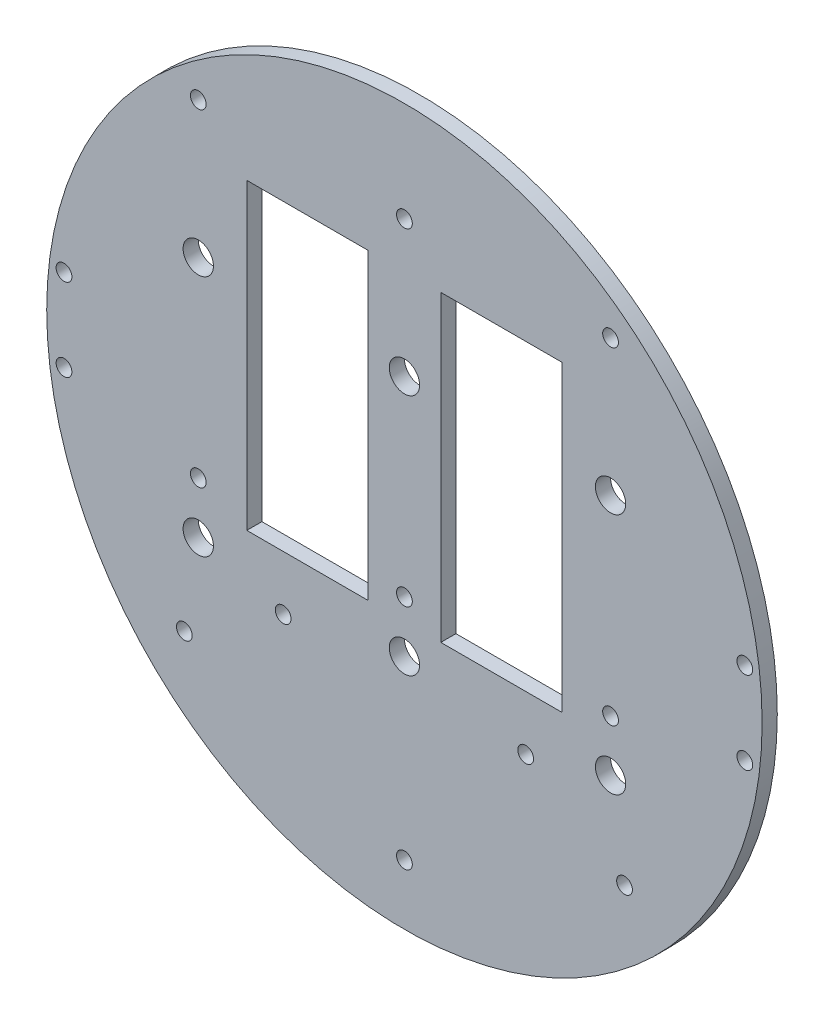
ISO-10303-21;
HEADER;
FILE_DESCRIPTION(('STEP AP214'),'2;1');
FILE_NAME('part.step','',(''),(''),'','','');
FILE_SCHEMA(('AUTOMOTIVE_DESIGN { 1 0 10303 214 1 1 1 1 }'));
ENDSEC;
DATA;
#1=APPLICATION_CONTEXT('core data for automotive mechanical design processes');
#2=APPLICATION_PROTOCOL_DEFINITION('international standard','automotive_design',2000,#1);
#3=PRODUCT_CONTEXT('',#1,'mechanical');
#4=PRODUCT('Part','Part','',(#3));
#5=PRODUCT_RELATED_PRODUCT_CATEGORY('part','',(#4));
#6=PRODUCT_DEFINITION_FORMATION('','',#4);
#7=PRODUCT_DEFINITION_CONTEXT('part definition',#1,'design');
#8=PRODUCT_DEFINITION('design','',#6,#7);
#9=PRODUCT_DEFINITION_SHAPE('','',#8);
#10=(LENGTH_UNIT() NAMED_UNIT(*) SI_UNIT(.MILLI.,.METRE.));
#11=(NAMED_UNIT(*) PLANE_ANGLE_UNIT() SI_UNIT($,.RADIAN.));
#12=(NAMED_UNIT(*) SI_UNIT($,.STERADIAN.) SOLID_ANGLE_UNIT());
#13=UNCERTAINTY_MEASURE_WITH_UNIT(LENGTH_MEASURE(1.E-05),#10,'distance_accuracy_value','');
#14=(GEOMETRIC_REPRESENTATION_CONTEXT(3) GLOBAL_UNCERTAINTY_ASSIGNED_CONTEXT((#13)) GLOBAL_UNIT_ASSIGNED_CONTEXT((#10,
#11,#12)) REPRESENTATION_CONTEXT('',''));
#15=CARTESIAN_POINT('',(0.,0.,0.));
#16=DIRECTION('',(0.,0.,1.));
#17=DIRECTION('',(1.,0.,0.));
#18=AXIS2_PLACEMENT_3D('',#15,#16,#17);
#19=CARTESIAN_POINT('',(0.,0.,3.175));
#20=DIRECTION('',(0.,0.,1.));
#21=DIRECTION('',(1.,0.,0.));
#22=AXIS2_PLACEMENT_3D('',#19,#20,#21);
#23=PLANE('',#22);
#24=CARTESIAN_POINT('',(71.3039757213085,8.63599999999998,3.175));
#25=DIRECTION('',(0.,0.,1.));
#26=DIRECTION('',(1.,0.,0.));
#27=AXIS2_PLACEMENT_3D('',#24,#25,#26);
#28=CIRCLE('',#27,1.65100000000001);
#29=CARTESIAN_POINT('',(72.9549757213085,8.63599999999998,3.175));
#30=VERTEX_POINT('',#29);
#31=EDGE_CURVE('E272',#30,#30,#28,.T.);
#32=ORIENTED_EDGE('',*,*,#31,.F.);
#33=EDGE_LOOP('',(#32));
#34=FACE_BOUND('',#33,.T.);
#35=CARTESIAN_POINT('',(-71.3039757213088,-8.63599999999998,3.175));
#36=DIRECTION('',(0.,0.,1.));
#37=DIRECTION('',(1.,0.,0.));
#38=AXIS2_PLACEMENT_3D('',#35,#36,#37);
#39=CIRCLE('',#38,1.65099999999999);
#40=CARTESIAN_POINT('',(-69.6529757213088,-8.63599999999998,3.175));
#41=VERTEX_POINT('',#40);
#42=EDGE_CURVE('E278',#41,#41,#39,.T.);
#43=ORIENTED_EDGE('',*,*,#42,.F.);
#44=EDGE_LOOP('',(#43));
#45=FACE_BOUND('',#44,.T.);
#46=CARTESIAN_POINT('',(-71.3039757213088,8.63600000000002,3.175));
#47=DIRECTION('',(0.,0.,1.));
#48=DIRECTION('',(1.,0.,0.));
#49=AXIS2_PLACEMENT_3D('',#46,#47,#48);
#50=CIRCLE('',#49,1.65099999999999);
#51=CARTESIAN_POINT('',(-69.6529757213088,8.63600000000002,3.175));
#52=VERTEX_POINT('',#51);
#53=EDGE_CURVE('E275',#52,#52,#50,.T.);
#54=ORIENTED_EDGE('',*,*,#53,.F.);
#55=EDGE_LOOP('',(#54));
#56=FACE_BOUND('',#55,.T.);
#57=CARTESIAN_POINT('',(71.3039757213085,-8.63600000000002,3.175));
#58=DIRECTION('',(0.,0.,1.));
#59=DIRECTION('',(1.,0.,0.));
#60=AXIS2_PLACEMENT_3D('',#57,#58,#59);
#61=CIRCLE('',#60,1.65100000000001);
#62=CARTESIAN_POINT('',(72.9549757213085,-8.63600000000002,3.175));
#63=VERTEX_POINT('',#62);
#64=EDGE_CURVE('E271',#63,#63,#61,.T.);
#65=ORIENTED_EDGE('',*,*,#64,.F.);
#66=EDGE_LOOP('',(#65));
#67=FACE_BOUND('',#66,.T.);
#68=DIRECTION('',(0.,-1.,0.));
#69=VECTOR('',#68,1.);
#70=CARTESIAN_POINT('',(-33.02,0.,3.175));
#71=LINE('',#70,#69);
#72=CARTESIAN_POINT('',(-33.02,44.45,3.175));
#73=VERTEX_POINT('',#72);
#74=CARTESIAN_POINT('',(-33.02,-19.05,3.175));
#75=VERTEX_POINT('',#74);
#76=EDGE_CURVE('E133',#73,#75,#71,.T.);
#77=ORIENTED_EDGE('',*,*,#76,.F.);
#78=DIRECTION('',(-1.,0.,0.));
#79=VECTOR('',#78,1.);
#80=CARTESIAN_POINT('',(0.,44.45,3.175));
#81=LINE('',#80,#79);
#82=CARTESIAN_POINT('',(-7.62000000000001,44.45,3.175));
#83=VERTEX_POINT('',#82);
#84=EDGE_CURVE('E126',#83,#73,#81,.T.);
#85=ORIENTED_EDGE('',*,*,#84,.F.);
#86=DIRECTION('',(0.,1.,0.));
#87=VECTOR('',#86,1.);
#88=CARTESIAN_POINT('',(-7.62,0.,3.175));
#89=LINE('',#88,#87);
#90=CARTESIAN_POINT('',(-7.62,-19.05,3.175));
#91=VERTEX_POINT('',#90);
#92=EDGE_CURVE('E106',#91,#83,#89,.T.);
#93=ORIENTED_EDGE('',*,*,#92,.F.);
#94=DIRECTION('',(1.,0.,0.));
#95=VECTOR('',#94,1.);
#96=CARTESIAN_POINT('',(0.,-19.05,3.175));
#97=LINE('',#96,#95);
#98=EDGE_CURVE('E131',#75,#91,#97,.T.);
#99=ORIENTED_EDGE('',*,*,#98,.F.);
#100=EDGE_LOOP('',(#77,#85,#93,#99));
#101=FACE_BOUND('',#100,.T.);
#102=DIRECTION('',(0.,1.,0.));
#103=VECTOR('',#102,1.);
#104=CARTESIAN_POINT('',(33.02,0.,3.175));
#105=LINE('',#104,#103);
#106=CARTESIAN_POINT('',(33.02,-19.05,3.175));
#107=VERTEX_POINT('',#106);
#108=CARTESIAN_POINT('',(33.02,44.45,3.175));
#109=VERTEX_POINT('',#108);
#110=EDGE_CURVE('E162',#107,#109,#105,.T.);
#111=ORIENTED_EDGE('',*,*,#110,.F.);
#112=DIRECTION('',(1.,0.,0.));
#113=VECTOR('',#112,1.);
#114=CARTESIAN_POINT('',(0.,-19.05,3.175));
#115=LINE('',#114,#113);
#116=CARTESIAN_POINT('',(7.62,-19.05,3.175));
#117=VERTEX_POINT('',#116);
#118=EDGE_CURVE('E149',#117,#107,#115,.T.);
#119=ORIENTED_EDGE('',*,*,#118,.F.);
#120=DIRECTION('',(0.,-1.,0.));
#121=VECTOR('',#120,1.);
#122=CARTESIAN_POINT('',(7.62,0.,3.175));
#123=LINE('',#122,#121);
#124=CARTESIAN_POINT('',(7.62000000000001,44.45,3.175));
#125=VERTEX_POINT('',#124);
#126=EDGE_CURVE('E157',#125,#117,#123,.T.);
#127=ORIENTED_EDGE('',*,*,#126,.F.);
#128=DIRECTION('',(-1.,0.,0.));
#129=VECTOR('',#128,1.);
#130=CARTESIAN_POINT('',(0.,44.45,3.175));
#131=LINE('',#130,#129);
#132=EDGE_CURVE('E160',#109,#125,#131,.T.);
#133=ORIENTED_EDGE('',*,*,#132,.F.);
#134=EDGE_LOOP('',(#111,#119,#127,#133));
#135=FACE_BOUND('',#134,.T.);
#136=CARTESIAN_POINT('',(-43.18,25.4,3.175));
#137=DIRECTION('',(0.,0.,1.));
#138=DIRECTION('',(1.,0.,0.));
#139=AXIS2_PLACEMENT_3D('',#136,#137,#138);
#140=CIRCLE('',#139,3.175);
#141=CARTESIAN_POINT('',(-40.005,25.4,3.175));
#142=VERTEX_POINT('',#141);
#143=EDGE_CURVE('E191',#142,#142,#140,.T.);
#144=ORIENTED_EDGE('',*,*,#143,.F.);
#145=EDGE_LOOP('',(#144));
#146=FACE_BOUND('',#145,.T.);
#147=CARTESIAN_POINT('',(43.18,25.4,3.175));
#148=DIRECTION('',(0.,0.,1.));
#149=DIRECTION('',(1.,0.,0.));
#150=AXIS2_PLACEMENT_3D('',#147,#148,#149);
#151=CIRCLE('',#150,3.175);
#152=CARTESIAN_POINT('',(46.355,25.4,3.175));
#153=VERTEX_POINT('',#152);
#154=EDGE_CURVE('E188',#153,#153,#151,.T.);
#155=ORIENTED_EDGE('',*,*,#154,.F.);
#156=EDGE_LOOP('',(#155));
#157=FACE_BOUND('',#156,.T.);
#158=CARTESIAN_POINT('',(43.18,-25.4,3.175));
#159=DIRECTION('',(0.,0.,1.));
#160=DIRECTION('',(1.,0.,0.));
#161=AXIS2_PLACEMENT_3D('',#158,#159,#160);
#162=CIRCLE('',#161,3.175);
#163=CARTESIAN_POINT('',(46.355,-25.4,3.175));
#164=VERTEX_POINT('',#163);
#165=EDGE_CURVE('E185',#164,#164,#162,.T.);
#166=ORIENTED_EDGE('',*,*,#165,.F.);
#167=EDGE_LOOP('',(#166));
#168=FACE_BOUND('',#167,.T.);
#169=CARTESIAN_POINT('',(0.,-25.4,3.175));
#170=DIRECTION('',(0.,0.,1.));
#171=DIRECTION('',(1.,0.,0.));
#172=AXIS2_PLACEMENT_3D('',#169,#170,#171);
#173=CIRCLE('',#172,3.175);
#174=CARTESIAN_POINT('',(3.175,-25.4,3.175));
#175=VERTEX_POINT('',#174);
#176=EDGE_CURVE('E182',#175,#175,#173,.T.);
#177=ORIENTED_EDGE('',*,*,#176,.F.);
#178=EDGE_LOOP('',(#177));
#179=FACE_BOUND('',#178,.T.);
#180=CARTESIAN_POINT('',(-43.18,-25.4,3.175));
#181=DIRECTION('',(0.,0.,1.));
#182=DIRECTION('',(1.,0.,0.));
#183=AXIS2_PLACEMENT_3D('',#180,#181,#182);
#184=CIRCLE('',#183,3.175);
#185=CARTESIAN_POINT('',(-40.005,-25.4,3.175));
#186=VERTEX_POINT('',#185);
#187=EDGE_CURVE('E168',#186,#186,#184,.T.);
#188=ORIENTED_EDGE('',*,*,#187,.F.);
#189=EDGE_LOOP('',(#188));
#190=FACE_BOUND('',#189,.T.);
#191=CARTESIAN_POINT('',(0.,25.4,3.175));
#192=DIRECTION('',(0.,0.,1.));
#193=DIRECTION('',(1.,0.,0.));
#194=AXIS2_PLACEMENT_3D('',#191,#192,#193);
#195=CIRCLE('',#194,3.175);
#196=CARTESIAN_POINT('',(3.175,25.4,3.175));
#197=VERTEX_POINT('',#196);
#198=EDGE_CURVE('E197',#197,#197,#195,.T.);
#199=ORIENTED_EDGE('',*,*,#198,.F.);
#200=EDGE_LOOP('',(#199));
#201=FACE_BOUND('',#200,.T.);
#202=CARTESIAN_POINT('',(0.,0.,3.175));
#203=DIRECTION('',(0.,0.,1.));
#204=DIRECTION('',(1.,0.,0.));
#205=AXIS2_PLACEMENT_3D('',#202,#203,#204);
#206=CIRCLE('',#205,74.93);
#207=CARTESIAN_POINT('',(74.93,0.,3.175));
#208=VERTEX_POINT('',#207);
#209=EDGE_CURVE('E11',#208,#208,#206,.T.);
#210=ORIENTED_EDGE('',*,*,#209,.T.);
#211=EDGE_LOOP('',(#210));
#212=FACE_BOUND('',#211,.T.);
#213=CARTESIAN_POINT('',(25.4,-30.48,3.175));
#214=DIRECTION('',(0.,0.,-1.));
#215=DIRECTION('',(-1.,0.,0.));
#216=AXIS2_PLACEMENT_3D('',#213,#214,#215);
#217=CIRCLE('',#216,1.651);
#218=CARTESIAN_POINT('',(23.749,-30.48,3.175));
#219=VERTEX_POINT('',#218);
#220=EDGE_CURVE('E226',#219,#219,#217,.T.);
#221=ORIENTED_EDGE('',*,*,#220,.T.);
#222=EDGE_LOOP('',(#221));
#223=FACE_BOUND('',#222,.T.);
#224=CARTESIAN_POINT('',(-25.4,-30.48,3.175));
#225=DIRECTION('',(0.,0.,-1.));
#226=DIRECTION('',(1.,0.,0.));
#227=AXIS2_PLACEMENT_3D('',#224,#225,#226);
#228=CIRCLE('',#227,1.651);
#229=CARTESIAN_POINT('',(-23.749,-30.48,3.175));
#230=VERTEX_POINT('',#229);
#231=EDGE_CURVE('E220',#230,#230,#228,.T.);
#232=ORIENTED_EDGE('',*,*,#231,.T.);
#233=EDGE_LOOP('',(#232));
#234=FACE_BOUND('',#233,.T.);
#235=CARTESIAN_POINT('',(0.,-62.3219988,3.175));
#236=DIRECTION('',(0.,0.,-1.));
#237=DIRECTION('',(-1.,0.,0.));
#238=AXIS2_PLACEMENT_3D('',#235,#236,#237);
#239=CIRCLE('',#238,1.651);
#240=CARTESIAN_POINT('',(-1.65100000000002,-62.3219988,3.175));
#241=VERTEX_POINT('',#240);
#242=EDGE_CURVE('E214',#241,#241,#239,.T.);
#243=ORIENTED_EDGE('',*,*,#242,.T.);
#244=EDGE_LOOP('',(#243));
#245=FACE_BOUND('',#244,.T.);
#246=CARTESIAN_POINT('',(43.18,53.975,3.175));
#247=DIRECTION('',(0.,0.,-1.));
#248=DIRECTION('',(-1.,0.,0.));
#249=AXIS2_PLACEMENT_3D('',#246,#247,#248);
#250=CIRCLE('',#249,1.651);
#251=CARTESIAN_POINT('',(41.529,53.975,3.175));
#252=VERTEX_POINT('',#251);
#253=EDGE_CURVE('E208',#252,#252,#250,.T.);
#254=ORIENTED_EDGE('',*,*,#253,.T.);
#255=EDGE_LOOP('',(#254));
#256=FACE_BOUND('',#255,.T.);
#257=CARTESIAN_POINT('',(46.101,-43.8609994,3.175));
#258=DIRECTION('',(0.,0.,-1.));
#259=DIRECTION('',(-1.,0.,0.));
#260=AXIS2_PLACEMENT_3D('',#257,#258,#259);
#261=CIRCLE('',#260,1.651);
#262=CARTESIAN_POINT('',(44.45,-43.8609994,3.175));
#263=VERTEX_POINT('',#262);
#264=EDGE_CURVE('E201',#263,#263,#261,.T.);
#265=ORIENTED_EDGE('',*,*,#264,.T.);
#266=EDGE_LOOP('',(#265));
#267=FACE_BOUND('',#266,.T.);
#268=CARTESIAN_POINT('',(-43.18,53.975,3.175));
#269=DIRECTION('',(0.,0.,-1.));
#270=DIRECTION('',(-1.,0.,0.));
#271=AXIS2_PLACEMENT_3D('',#268,#269,#270);
#272=CIRCLE('',#271,1.651);
#273=CARTESIAN_POINT('',(-44.831,53.975,3.175));
#274=VERTEX_POINT('',#273);
#275=EDGE_CURVE('E249',#274,#274,#272,.T.);
#276=ORIENTED_EDGE('',*,*,#275,.T.);
#277=EDGE_LOOP('',(#276));
#278=FACE_BOUND('',#277,.T.);
#279=CARTESIAN_POINT('',(0.,-14.605,3.175));
#280=DIRECTION('',(0.,0.,-1.));
#281=DIRECTION('',(-1.,0.,0.));
#282=AXIS2_PLACEMENT_3D('',#279,#280,#281);
#283=CIRCLE('',#282,1.651);
#284=CARTESIAN_POINT('',(-1.65100000000001,-14.605,3.175));
#285=VERTEX_POINT('',#284);
#286=EDGE_CURVE('E256',#285,#285,#283,.T.);
#287=ORIENTED_EDGE('',*,*,#286,.T.);
#288=EDGE_LOOP('',(#287));
#289=FACE_BOUND('',#288,.T.);
#290=CARTESIAN_POINT('',(-46.101,-43.8609994,3.175));
#291=DIRECTION('',(0.,0.,-1.));
#292=DIRECTION('',(-1.,0.,0.));
#293=AXIS2_PLACEMENT_3D('',#290,#291,#292);
#294=CIRCLE('',#293,1.65100000000001);
#295=CARTESIAN_POINT('',(-47.752,-43.8609994,3.175));
#296=VERTEX_POINT('',#295);
#297=EDGE_CURVE('E238',#296,#296,#294,.T.);
#298=ORIENTED_EDGE('',*,*,#297,.T.);
#299=EDGE_LOOP('',(#298));
#300=FACE_BOUND('',#299,.T.);
#301=CARTESIAN_POINT('',(43.18,-14.605,3.175));
#302=DIRECTION('',(0.,0.,-1.));
#303=DIRECTION('',(-1.,0.,0.));
#304=AXIS2_PLACEMENT_3D('',#301,#302,#303);
#305=CIRCLE('',#304,1.651);
#306=CARTESIAN_POINT('',(41.529,-14.605,3.175));
#307=VERTEX_POINT('',#306);
#308=EDGE_CURVE('E231',#307,#307,#305,.T.);
#309=ORIENTED_EDGE('',*,*,#308,.T.);
#310=EDGE_LOOP('',(#309));
#311=FACE_BOUND('',#310,.T.);
#312=CARTESIAN_POINT('',(-43.18,-14.605,3.175));
#313=DIRECTION('',(0.,0.,-1.));
#314=DIRECTION('',(-1.,0.,0.));
#315=AXIS2_PLACEMENT_3D('',#312,#313,#314);
#316=CIRCLE('',#315,1.651);
#317=CARTESIAN_POINT('',(-44.831,-14.605,3.175));
#318=VERTEX_POINT('',#317);
#319=EDGE_CURVE('E243',#318,#318,#316,.T.);
#320=ORIENTED_EDGE('',*,*,#319,.T.);
#321=EDGE_LOOP('',(#320));
#322=FACE_BOUND('',#321,.T.);
#323=CARTESIAN_POINT('',(0.,53.975,3.175));
#324=DIRECTION('',(0.,0.,-1.));
#325=DIRECTION('',(-1.,0.,0.));
#326=AXIS2_PLACEMENT_3D('',#323,#324,#325);
#327=CIRCLE('',#326,1.65099999999999);
#328=CARTESIAN_POINT('',(-1.651,53.975,3.175));
#329=VERTEX_POINT('',#328);
#330=EDGE_CURVE('E261',#329,#329,#327,.T.);
#331=ORIENTED_EDGE('',*,*,#330,.T.);
#332=EDGE_LOOP('',(#331));
#333=FACE_BOUND('',#332,.T.);
#334=ADVANCED_FACE('F33',(#34,#45,#56,#67,#101,#135,#146,#157,#168,#179,#190,#201,#212,#223,
#234,#245,#256,#267,#278,#289,#300,#311,#322,#333),#23,.T.);
#335=CARTESIAN_POINT('',(0.,0.,0.));
#336=DIRECTION('',(0.,0.,1.));
#337=DIRECTION('',(1.,0.,0.));
#338=AXIS2_PLACEMENT_3D('',#335,#336,#337);
#339=PLANE('',#338);
#340=CARTESIAN_POINT('',(71.3039757213085,8.63599999999998,0.));
#341=DIRECTION('',(0.,0.,1.));
#342=DIRECTION('',(1.,0.,0.));
#343=AXIS2_PLACEMENT_3D('',#340,#341,#342);
#344=CIRCLE('',#343,1.65100000000001);
#345=CARTESIAN_POINT('',(72.9549757213085,8.63599999999998,0.));
#346=VERTEX_POINT('',#345);
#347=EDGE_CURVE('E37',#346,#346,#344,.T.);
#348=ORIENTED_EDGE('',*,*,#347,.T.);
#349=EDGE_LOOP('',(#348));
#350=FACE_BOUND('',#349,.T.);
#351=CARTESIAN_POINT('',(-71.3039757213088,-8.63599999999998,0.));
#352=DIRECTION('',(0.,0.,1.));
#353=DIRECTION('',(1.,0.,0.));
#354=AXIS2_PLACEMENT_3D('',#351,#352,#353);
#355=CIRCLE('',#354,1.65099999999999);
#356=CARTESIAN_POINT('',(-69.6529757213088,-8.63599999999998,0.));
#357=VERTEX_POINT('',#356);
#358=EDGE_CURVE('E276',#357,#357,#355,.T.);
#359=ORIENTED_EDGE('',*,*,#358,.T.);
#360=EDGE_LOOP('',(#359));
#361=FACE_BOUND('',#360,.T.);
#362=CARTESIAN_POINT('',(-71.3039757213088,8.63600000000002,0.));
#363=DIRECTION('',(0.,0.,1.));
#364=DIRECTION('',(1.,0.,0.));
#365=AXIS2_PLACEMENT_3D('',#362,#363,#364);
#366=CIRCLE('',#365,1.65099999999999);
#367=CARTESIAN_POINT('',(-69.6529757213088,8.63600000000002,0.));
#368=VERTEX_POINT('',#367);
#369=EDGE_CURVE('E273',#368,#368,#366,.T.);
#370=ORIENTED_EDGE('',*,*,#369,.T.);
#371=EDGE_LOOP('',(#370));
#372=FACE_BOUND('',#371,.T.);
#373=CARTESIAN_POINT('',(71.3039757213085,-8.63600000000002,0.));
#374=DIRECTION('',(0.,0.,1.));
#375=DIRECTION('',(1.,0.,0.));
#376=AXIS2_PLACEMENT_3D('',#373,#374,#375);
#377=CIRCLE('',#376,1.65100000000001);
#378=CARTESIAN_POINT('',(72.9549757213085,-8.63600000000002,0.));
#379=VERTEX_POINT('',#378);
#380=EDGE_CURVE('E268',#379,#379,#377,.T.);
#381=ORIENTED_EDGE('',*,*,#380,.T.);
#382=EDGE_LOOP('',(#381));
#383=FACE_BOUND('',#382,.T.);
#384=DIRECTION('',(1.,0.,0.));
#385=VECTOR('',#384,1.);
#386=CARTESIAN_POINT('',(-33.02,44.45,0.));
#387=LINE('',#386,#385);
#388=CARTESIAN_POINT('',(-33.02,44.45,0.));
#389=VERTEX_POINT('',#388);
#390=CARTESIAN_POINT('',(-7.62000000000001,44.45,0.));
#391=VERTEX_POINT('',#390);
#392=EDGE_CURVE('E112',#389,#391,#387,.T.);
#393=ORIENTED_EDGE('',*,*,#392,.F.);
#394=DIRECTION('',(0.,1.,0.));
#395=VECTOR('',#394,1.);
#396=CARTESIAN_POINT('',(-33.02,44.45,0.));
#397=LINE('',#396,#395);
#398=CARTESIAN_POINT('',(-33.02,-19.05,0.));
#399=VERTEX_POINT('',#398);
#400=EDGE_CURVE('E58',#399,#389,#397,.T.);
#401=ORIENTED_EDGE('',*,*,#400,.F.);
#402=DIRECTION('',(-1.,0.,0.));
#403=VECTOR('',#402,1.);
#404=CARTESIAN_POINT('',(-33.02,-19.05,0.));
#405=LINE('',#404,#403);
#406=CARTESIAN_POINT('',(-7.62,-19.05,0.));
#407=VERTEX_POINT('',#406);
#408=EDGE_CURVE('E119',#407,#399,#405,.T.);
#409=ORIENTED_EDGE('',*,*,#408,.F.);
#410=DIRECTION('',(0.,-1.,0.));
#411=VECTOR('',#410,1.);
#412=CARTESIAN_POINT('',(-7.62000000000001,44.45,0.));
#413=LINE('',#412,#411);
#414=EDGE_CURVE('E103',#391,#407,#413,.T.);
#415=ORIENTED_EDGE('',*,*,#414,.F.);
#416=EDGE_LOOP('',(#393,#401,#409,#415));
#417=FACE_BOUND('',#416,.T.);
#418=DIRECTION('',(-1.,0.,0.));
#419=VECTOR('',#418,1.);
#420=CARTESIAN_POINT('',(33.02,-19.05,0.));
#421=LINE('',#420,#419);
#422=CARTESIAN_POINT('',(33.02,-19.05,0.));
#423=VERTEX_POINT('',#422);
#424=CARTESIAN_POINT('',(7.62,-19.05,0.));
#425=VERTEX_POINT('',#424);
#426=EDGE_CURVE('E137',#423,#425,#421,.T.);
#427=ORIENTED_EDGE('',*,*,#426,.F.);
#428=DIRECTION('',(0.,-1.,0.));
#429=VECTOR('',#428,1.);
#430=CARTESIAN_POINT('',(33.02,44.45,0.));
#431=LINE('',#430,#429);
#432=CARTESIAN_POINT('',(33.02,44.45,0.));
#433=VERTEX_POINT('',#432);
#434=EDGE_CURVE('E135',#433,#423,#431,.T.);
#435=ORIENTED_EDGE('',*,*,#434,.F.);
#436=DIRECTION('',(1.,0.,0.));
#437=VECTOR('',#436,1.);
#438=CARTESIAN_POINT('',(33.02,44.45,0.));
#439=LINE('',#438,#437);
#440=CARTESIAN_POINT('',(7.62000000000001,44.45,0.));
#441=VERTEX_POINT('',#440);
#442=EDGE_CURVE('E143',#441,#433,#439,.T.);
#443=ORIENTED_EDGE('',*,*,#442,.F.);
#444=DIRECTION('',(0.,1.,0.));
#445=VECTOR('',#444,1.);
#446=CARTESIAN_POINT('',(7.62000000000001,44.45,0.));
#447=LINE('',#446,#445);
#448=EDGE_CURVE('E140',#425,#441,#447,.T.);
#449=ORIENTED_EDGE('',*,*,#448,.F.);
#450=EDGE_LOOP('',(#427,#435,#443,#449));
#451=FACE_BOUND('',#450,.T.);
#452=CARTESIAN_POINT('',(-43.18,25.4,0.));
#453=DIRECTION('',(0.,0.,-1.));
#454=DIRECTION('',(-1.,0.,0.));
#455=AXIS2_PLACEMENT_3D('',#452,#453,#454);
#456=CIRCLE('',#455,3.175);
#457=CARTESIAN_POINT('',(-46.355,25.4,0.));
#458=VERTEX_POINT('',#457);
#459=EDGE_CURVE('E165',#458,#458,#456,.T.);
#460=ORIENTED_EDGE('',*,*,#459,.F.);
#461=EDGE_LOOP('',(#460));
#462=FACE_BOUND('',#461,.T.);
#463=CARTESIAN_POINT('',(43.18,25.4,0.));
#464=DIRECTION('',(0.,0.,-1.));
#465=DIRECTION('',(1.,0.,0.));
#466=AXIS2_PLACEMENT_3D('',#463,#464,#465);
#467=CIRCLE('',#466,3.175);
#468=CARTESIAN_POINT('',(46.355,25.4,0.));
#469=VERTEX_POINT('',#468);
#470=EDGE_CURVE('E169',#469,#469,#467,.T.);
#471=ORIENTED_EDGE('',*,*,#470,.F.);
#472=EDGE_LOOP('',(#471));
#473=FACE_BOUND('',#472,.T.);
#474=CARTESIAN_POINT('',(43.18,-25.4,0.));
#475=DIRECTION('',(0.,0.,-1.));
#476=DIRECTION('',(-1.,0.,0.));
#477=AXIS2_PLACEMENT_3D('',#474,#475,#476);
#478=CIRCLE('',#477,3.175);
#479=CARTESIAN_POINT('',(40.005,-25.4,0.));
#480=VERTEX_POINT('',#479);
#481=EDGE_CURVE('E172',#480,#480,#478,.T.);
#482=ORIENTED_EDGE('',*,*,#481,.F.);
#483=EDGE_LOOP('',(#482));
#484=FACE_BOUND('',#483,.T.);
#485=CARTESIAN_POINT('',(0.,-25.4,0.));
#486=DIRECTION('',(0.,0.,-1.));
#487=DIRECTION('',(1.,0.,0.));
#488=AXIS2_PLACEMENT_3D('',#485,#486,#487);
#489=CIRCLE('',#488,3.175);
#490=CARTESIAN_POINT('',(3.175,-25.4,0.));
#491=VERTEX_POINT('',#490);
#492=EDGE_CURVE('E175',#491,#491,#489,.T.);
#493=ORIENTED_EDGE('',*,*,#492,.F.);
#494=EDGE_LOOP('',(#493));
#495=FACE_BOUND('',#494,.T.);
#496=CARTESIAN_POINT('',(-43.18,-25.4,0.));
#497=DIRECTION('',(0.,0.,-1.));
#498=DIRECTION('',(1.,0.,0.));
#499=AXIS2_PLACEMENT_3D('',#496,#497,#498);
#500=CIRCLE('',#499,3.175);
#501=CARTESIAN_POINT('',(-40.005,-25.4,0.));
#502=VERTEX_POINT('',#501);
#503=EDGE_CURVE('E164',#502,#502,#500,.T.);
#504=ORIENTED_EDGE('',*,*,#503,.F.);
#505=EDGE_LOOP('',(#504));
#506=FACE_BOUND('',#505,.T.);
#507=CARTESIAN_POINT('',(0.,25.4,0.));
#508=DIRECTION('',(0.,0.,-1.));
#509=DIRECTION('',(-1.,0.,0.));
#510=AXIS2_PLACEMENT_3D('',#507,#508,#509);
#511=CIRCLE('',#510,3.175);
#512=CARTESIAN_POINT('',(-3.175,25.4,0.));
#513=VERTEX_POINT('',#512);
#514=EDGE_CURVE('E194',#513,#513,#511,.T.);
#515=ORIENTED_EDGE('',*,*,#514,.F.);
#516=EDGE_LOOP('',(#515));
#517=FACE_BOUND('',#516,.T.);
#518=CARTESIAN_POINT('',(25.4,-30.48,0.));
#519=DIRECTION('',(0.,0.,-1.));
#520=DIRECTION('',(-1.,0.,0.));
#521=AXIS2_PLACEMENT_3D('',#518,#519,#520);
#522=CIRCLE('',#521,1.651);
#523=CARTESIAN_POINT('',(23.749,-30.48,0.));
#524=VERTEX_POINT('',#523);
#525=EDGE_CURVE('E200',#524,#524,#522,.T.);
#526=ORIENTED_EDGE('',*,*,#525,.F.);
#527=EDGE_LOOP('',(#526));
#528=FACE_BOUND('',#527,.T.);
#529=CARTESIAN_POINT('',(-25.4,-30.48,0.));
#530=DIRECTION('',(0.,0.,-1.));
#531=DIRECTION('',(1.,0.,0.));
#532=AXIS2_PLACEMENT_3D('',#529,#530,#531);
#533=CIRCLE('',#532,1.651);
#534=CARTESIAN_POINT('',(-23.749,-30.48,0.));
#535=VERTEX_POINT('',#534);
#536=EDGE_CURVE('E223',#535,#535,#533,.T.);
#537=ORIENTED_EDGE('',*,*,#536,.F.);
#538=EDGE_LOOP('',(#537));
#539=FACE_BOUND('',#538,.T.);
#540=CARTESIAN_POINT('',(0.,-62.3219988,0.));
#541=DIRECTION('',(0.,0.,-1.));
#542=DIRECTION('',(-1.,0.,0.));
#543=AXIS2_PLACEMENT_3D('',#540,#541,#542);
#544=CIRCLE('',#543,1.651);
#545=CARTESIAN_POINT('',(-1.65100000000002,-62.3219988,0.));
#546=VERTEX_POINT('',#545);
#547=EDGE_CURVE('E217',#546,#546,#544,.T.);
#548=ORIENTED_EDGE('',*,*,#547,.F.);
#549=EDGE_LOOP('',(#548));
#550=FACE_BOUND('',#549,.T.);
#551=CARTESIAN_POINT('',(43.18,53.975,0.));
#552=DIRECTION('',(0.,0.,-1.));
#553=DIRECTION('',(-1.,0.,0.));
#554=AXIS2_PLACEMENT_3D('',#551,#552,#553);
#555=CIRCLE('',#554,1.651);
#556=CARTESIAN_POINT('',(41.529,53.975,0.));
#557=VERTEX_POINT('',#556);
#558=EDGE_CURVE('E211',#557,#557,#555,.T.);
#559=ORIENTED_EDGE('',*,*,#558,.F.);
#560=EDGE_LOOP('',(#559));
#561=FACE_BOUND('',#560,.T.);
#562=CARTESIAN_POINT('',(46.101,-43.8609994,0.));
#563=DIRECTION('',(0.,0.,-1.));
#564=DIRECTION('',(-1.,0.,0.));
#565=AXIS2_PLACEMENT_3D('',#562,#563,#564);
#566=CIRCLE('',#565,1.651);
#567=CARTESIAN_POINT('',(44.45,-43.8609994,0.));
#568=VERTEX_POINT('',#567);
#569=EDGE_CURVE('E205',#568,#568,#566,.T.);
#570=ORIENTED_EDGE('',*,*,#569,.F.);
#571=EDGE_LOOP('',(#570));
#572=FACE_BOUND('',#571,.T.);
#573=CARTESIAN_POINT('',(-43.18,53.975,0.));
#574=DIRECTION('',(0.,0.,-1.));
#575=DIRECTION('',(-1.,0.,0.));
#576=AXIS2_PLACEMENT_3D('',#573,#574,#575);
#577=CIRCLE('',#576,1.651);
#578=CARTESIAN_POINT('',(-44.831,53.975,0.));
#579=VERTEX_POINT('',#578);
#580=EDGE_CURVE('E253',#579,#579,#577,.T.);
#581=ORIENTED_EDGE('',*,*,#580,.F.);
#582=EDGE_LOOP('',(#581));
#583=FACE_BOUND('',#582,.T.);
#584=CARTESIAN_POINT('',(0.,-14.605,0.));
#585=DIRECTION('',(0.,0.,-1.));
#586=DIRECTION('',(-1.,0.,0.));
#587=AXIS2_PLACEMENT_3D('',#584,#585,#586);
#588=CIRCLE('',#587,1.651);
#589=CARTESIAN_POINT('',(-1.65100000000001,-14.605,0.));
#590=VERTEX_POINT('',#589);
#591=EDGE_CURVE('E246',#590,#590,#588,.T.);
#592=ORIENTED_EDGE('',*,*,#591,.F.);
#593=EDGE_LOOP('',(#592));
#594=FACE_BOUND('',#593,.T.);
#595=CARTESIAN_POINT('',(-46.101,-43.8609994,0.));
#596=DIRECTION('',(0.,0.,-1.));
#597=DIRECTION('',(-1.,0.,0.));
#598=AXIS2_PLACEMENT_3D('',#595,#596,#597);
#599=CIRCLE('',#598,1.65100000000001);
#600=CARTESIAN_POINT('',(-47.752,-43.8609994,0.));
#601=VERTEX_POINT('',#600);
#602=EDGE_CURVE('E204',#601,#601,#599,.T.);
#603=ORIENTED_EDGE('',*,*,#602,.F.);
#604=EDGE_LOOP('',(#603));
#605=FACE_BOUND('',#604,.T.);
#606=CARTESIAN_POINT('',(43.18,-14.605,0.));
#607=DIRECTION('',(0.,0.,-1.));
#608=DIRECTION('',(-1.,0.,0.));
#609=AXIS2_PLACEMENT_3D('',#606,#607,#608);
#610=CIRCLE('',#609,1.651);
#611=CARTESIAN_POINT('',(41.529,-14.605,0.));
#612=VERTEX_POINT('',#611);
#613=EDGE_CURVE('E235',#612,#612,#610,.T.);
#614=ORIENTED_EDGE('',*,*,#613,.F.);
#615=EDGE_LOOP('',(#614));
#616=FACE_BOUND('',#615,.T.);
#617=CARTESIAN_POINT('',(-43.18,-14.605,0.));
#618=DIRECTION('',(0.,0.,-1.));
#619=DIRECTION('',(-1.,0.,0.));
#620=AXIS2_PLACEMENT_3D('',#617,#618,#619);
#621=CIRCLE('',#620,1.651);
#622=CARTESIAN_POINT('',(-44.831,-14.605,0.));
#623=VERTEX_POINT('',#622);
#624=EDGE_CURVE('E234',#623,#623,#621,.T.);
#625=ORIENTED_EDGE('',*,*,#624,.F.);
#626=EDGE_LOOP('',(#625));
#627=FACE_BOUND('',#626,.T.);
#628=CARTESIAN_POINT('',(0.,53.975,0.));
#629=DIRECTION('',(0.,0.,-1.));
#630=DIRECTION('',(-1.,0.,0.));
#631=AXIS2_PLACEMENT_3D('',#628,#629,#630);
#632=CIRCLE('',#631,1.65099999999999);
#633=CARTESIAN_POINT('',(-1.651,53.975,0.));
#634=VERTEX_POINT('',#633);
#635=EDGE_CURVE('E252',#634,#634,#632,.T.);
#636=ORIENTED_EDGE('',*,*,#635,.F.);
#637=EDGE_LOOP('',(#636));
#638=FACE_BOUND('',#637,.T.);
#639=CARTESIAN_POINT('',(0.,0.,0.));
#640=DIRECTION('',(0.,0.,1.));
#641=DIRECTION('',(1.,0.,0.));
#642=AXIS2_PLACEMENT_3D('',#639,#640,#641);
#643=CIRCLE('',#642,74.93);
#644=CARTESIAN_POINT('',(74.93,0.,0.));
#645=VERTEX_POINT('',#644);
#646=EDGE_CURVE('E42',#645,#645,#643,.T.);
#647=ORIENTED_EDGE('',*,*,#646,.F.);
#648=EDGE_LOOP('',(#647));
#649=FACE_BOUND('',#648,.T.);
#650=ADVANCED_FACE('F116',(#350,#361,#372,#383,#417,#451,#462,#473,#484,#495,#506,#517,#528,
#539,#550,#561,#572,#583,#594,#605,#616,#627,#638,#649),#339,.F.);
#651=CARTESIAN_POINT('',(0.,0.,3.175));
#652=DIRECTION('',(0.,0.,-1.));
#653=DIRECTION('',(-1.,0.,0.));
#654=AXIS2_PLACEMENT_3D('',#651,#652,#653);
#655=CYLINDRICAL_SURFACE('',#654,74.93);
#656=ORIENTED_EDGE('',*,*,#646,.T.);
#657=EDGE_LOOP('',(#656));
#658=FACE_BOUND('',#657,.T.);
#659=ORIENTED_EDGE('',*,*,#209,.F.);
#660=EDGE_LOOP('',(#659));
#661=FACE_BOUND('',#660,.T.);
#662=ADVANCED_FACE('F35',(#658,#661),#655,.T.);
#663=CARTESIAN_POINT('',(0.,53.975,3.175));
#664=DIRECTION('',(0.,0.,-1.));
#665=DIRECTION('',(-1.,0.,0.));
#666=AXIS2_PLACEMENT_3D('',#663,#664,#665);
#667=CYLINDRICAL_SURFACE('',#666,1.65099999999999);
#668=ORIENTED_EDGE('',*,*,#330,.F.);
#669=EDGE_LOOP('',(#668));
#670=FACE_BOUND('',#669,.T.);
#671=ORIENTED_EDGE('',*,*,#635,.T.);
#672=EDGE_LOOP('',(#671));
#673=FACE_BOUND('',#672,.T.);
#674=ADVANCED_FACE('F343',(#670,#673),#667,.F.);
#675=CARTESIAN_POINT('',(-43.18,-14.605,3.175));
#676=DIRECTION('',(0.,0.,-1.));
#677=DIRECTION('',(-1.,0.,0.));
#678=AXIS2_PLACEMENT_3D('',#675,#676,#677);
#679=CYLINDRICAL_SURFACE('',#678,1.651);
#680=ORIENTED_EDGE('',*,*,#319,.F.);
#681=EDGE_LOOP('',(#680));
#682=FACE_BOUND('',#681,.T.);
#683=ORIENTED_EDGE('',*,*,#624,.T.);
#684=EDGE_LOOP('',(#683));
#685=FACE_BOUND('',#684,.T.);
#686=ADVANCED_FACE('F346',(#682,#685),#679,.F.);
#687=CARTESIAN_POINT('',(43.18,-14.605,3.175));
#688=DIRECTION('',(0.,0.,-1.));
#689=DIRECTION('',(-1.,0.,0.));
#690=AXIS2_PLACEMENT_3D('',#687,#688,#689);
#691=CYLINDRICAL_SURFACE('',#690,1.651);
#692=ORIENTED_EDGE('',*,*,#308,.F.);
#693=EDGE_LOOP('',(#692));
#694=FACE_BOUND('',#693,.T.);
#695=ORIENTED_EDGE('',*,*,#613,.T.);
#696=EDGE_LOOP('',(#695));
#697=FACE_BOUND('',#696,.T.);
#698=ADVANCED_FACE('F373',(#694,#697),#691,.F.);
#699=CARTESIAN_POINT('',(-46.101,-43.8609994,3.175));
#700=DIRECTION('',(0.,0.,-1.));
#701=DIRECTION('',(-1.,0.,0.));
#702=AXIS2_PLACEMENT_3D('',#699,#700,#701);
#703=CYLINDRICAL_SURFACE('',#702,1.65100000000001);
#704=ORIENTED_EDGE('',*,*,#297,.F.);
#705=EDGE_LOOP('',(#704));
#706=FACE_BOUND('',#705,.T.);
#707=ORIENTED_EDGE('',*,*,#602,.T.);
#708=EDGE_LOOP('',(#707));
#709=FACE_BOUND('',#708,.T.);
#710=ADVANCED_FACE('F381',(#706,#709),#703,.F.);
#711=CARTESIAN_POINT('',(0.,-14.605,3.175));
#712=DIRECTION('',(0.,0.,-1.));
#713=DIRECTION('',(-1.,0.,0.));
#714=AXIS2_PLACEMENT_3D('',#711,#712,#713);
#715=CYLINDRICAL_SURFACE('',#714,1.651);
#716=ORIENTED_EDGE('',*,*,#286,.F.);
#717=EDGE_LOOP('',(#716));
#718=FACE_BOUND('',#717,.T.);
#719=ORIENTED_EDGE('',*,*,#591,.T.);
#720=EDGE_LOOP('',(#719));
#721=FACE_BOUND('',#720,.T.);
#722=ADVANCED_FACE('F389',(#718,#721),#715,.F.);
#723=CARTESIAN_POINT('',(-43.18,53.975,3.175));
#724=DIRECTION('',(0.,0.,-1.));
#725=DIRECTION('',(-1.,0.,0.));
#726=AXIS2_PLACEMENT_3D('',#723,#724,#725);
#727=CYLINDRICAL_SURFACE('',#726,1.651);
#728=ORIENTED_EDGE('',*,*,#275,.F.);
#729=EDGE_LOOP('',(#728));
#730=FACE_BOUND('',#729,.T.);
#731=ORIENTED_EDGE('',*,*,#580,.T.);
#732=EDGE_LOOP('',(#731));
#733=FACE_BOUND('',#732,.T.);
#734=ADVANCED_FACE('F397',(#730,#733),#727,.F.);
#735=CARTESIAN_POINT('',(46.101,-43.8609994,3.175));
#736=DIRECTION('',(0.,0.,-1.));
#737=DIRECTION('',(-1.,0.,0.));
#738=AXIS2_PLACEMENT_3D('',#735,#736,#737);
#739=CYLINDRICAL_SURFACE('',#738,1.651);
#740=ORIENTED_EDGE('',*,*,#264,.F.);
#741=EDGE_LOOP('',(#740));
#742=FACE_BOUND('',#741,.T.);
#743=ORIENTED_EDGE('',*,*,#569,.T.);
#744=EDGE_LOOP('',(#743));
#745=FACE_BOUND('',#744,.T.);
#746=ADVANCED_FACE('F405',(#742,#745),#739,.F.);
#747=CARTESIAN_POINT('',(43.18,53.975,3.175));
#748=DIRECTION('',(0.,0.,-1.));
#749=DIRECTION('',(-1.,0.,0.));
#750=AXIS2_PLACEMENT_3D('',#747,#748,#749);
#751=CYLINDRICAL_SURFACE('',#750,1.651);
#752=ORIENTED_EDGE('',*,*,#253,.F.);
#753=EDGE_LOOP('',(#752));
#754=FACE_BOUND('',#753,.T.);
#755=ORIENTED_EDGE('',*,*,#558,.T.);
#756=EDGE_LOOP('',(#755));
#757=FACE_BOUND('',#756,.T.);
#758=ADVANCED_FACE('F413',(#754,#757),#751,.F.);
#759=CARTESIAN_POINT('',(0.,-62.3219988,3.175));
#760=DIRECTION('',(0.,0.,-1.));
#761=DIRECTION('',(-1.,0.,0.));
#762=AXIS2_PLACEMENT_3D('',#759,#760,#761);
#763=CYLINDRICAL_SURFACE('',#762,1.651);
#764=ORIENTED_EDGE('',*,*,#242,.F.);
#765=EDGE_LOOP('',(#764));
#766=FACE_BOUND('',#765,.T.);
#767=ORIENTED_EDGE('',*,*,#547,.T.);
#768=EDGE_LOOP('',(#767));
#769=FACE_BOUND('',#768,.T.);
#770=ADVANCED_FACE('F421',(#766,#769),#763,.F.);
#771=CARTESIAN_POINT('',(-25.4,-30.48,3.175));
#772=DIRECTION('',(0.,0.,-1.));
#773=DIRECTION('',(-1.,0.,0.));
#774=AXIS2_PLACEMENT_3D('',#771,#772,#773);
#775=CYLINDRICAL_SURFACE('',#774,1.651);
#776=ORIENTED_EDGE('',*,*,#231,.F.);
#777=EDGE_LOOP('',(#776));
#778=FACE_BOUND('',#777,.T.);
#779=ORIENTED_EDGE('',*,*,#536,.T.);
#780=EDGE_LOOP('',(#779));
#781=FACE_BOUND('',#780,.T.);
#782=ADVANCED_FACE('F429',(#778,#781),#775,.F.);
#783=CARTESIAN_POINT('',(25.4,-30.48,3.175));
#784=DIRECTION('',(0.,0.,-1.));
#785=DIRECTION('',(-1.,0.,0.));
#786=AXIS2_PLACEMENT_3D('',#783,#784,#785);
#787=CYLINDRICAL_SURFACE('',#786,1.651);
#788=ORIENTED_EDGE('',*,*,#220,.F.);
#789=EDGE_LOOP('',(#788));
#790=FACE_BOUND('',#789,.T.);
#791=ORIENTED_EDGE('',*,*,#525,.T.);
#792=EDGE_LOOP('',(#791));
#793=FACE_BOUND('',#792,.T.);
#794=ADVANCED_FACE('F437',(#790,#793),#787,.F.);
#795=CARTESIAN_POINT('',(0.,25.4,21.59));
#796=DIRECTION('',(0.,0.,-1.));
#797=DIRECTION('',(-1.,0.,0.));
#798=AXIS2_PLACEMENT_3D('',#795,#796,#797);
#799=CYLINDRICAL_SURFACE('',#798,3.175);
#800=ORIENTED_EDGE('',*,*,#198,.T.);
#801=EDGE_LOOP('',(#800));
#802=FACE_BOUND('',#801,.T.);
#803=ORIENTED_EDGE('',*,*,#514,.T.);
#804=EDGE_LOOP('',(#803));
#805=FACE_BOUND('',#804,.T.);
#806=ADVANCED_FACE('F444',(#802,#805),#799,.F.);
#807=CARTESIAN_POINT('',(-43.18,-25.4,21.59));
#808=DIRECTION('',(0.,0.,-1.));
#809=DIRECTION('',(-1.,0.,0.));
#810=AXIS2_PLACEMENT_3D('',#807,#808,#809);
#811=CYLINDRICAL_SURFACE('',#810,3.175);
#812=ORIENTED_EDGE('',*,*,#187,.T.);
#813=EDGE_LOOP('',(#812));
#814=FACE_BOUND('',#813,.T.);
#815=ORIENTED_EDGE('',*,*,#503,.T.);
#816=EDGE_LOOP('',(#815));
#817=FACE_BOUND('',#816,.T.);
#818=ADVANCED_FACE('F451',(#814,#817),#811,.F.);
#819=CARTESIAN_POINT('',(0.,-25.4,21.59));
#820=DIRECTION('',(0.,0.,-1.));
#821=DIRECTION('',(-1.,0.,0.));
#822=AXIS2_PLACEMENT_3D('',#819,#820,#821);
#823=CYLINDRICAL_SURFACE('',#822,3.175);
#824=ORIENTED_EDGE('',*,*,#176,.T.);
#825=EDGE_LOOP('',(#824));
#826=FACE_BOUND('',#825,.T.);
#827=ORIENTED_EDGE('',*,*,#492,.T.);
#828=EDGE_LOOP('',(#827));
#829=FACE_BOUND('',#828,.T.);
#830=ADVANCED_FACE('F459',(#826,#829),#823,.F.);
#831=CARTESIAN_POINT('',(43.18,-25.4,21.59));
#832=DIRECTION('',(0.,0.,-1.));
#833=DIRECTION('',(-1.,0.,0.));
#834=AXIS2_PLACEMENT_3D('',#831,#832,#833);
#835=CYLINDRICAL_SURFACE('',#834,3.175);
#836=ORIENTED_EDGE('',*,*,#165,.T.);
#837=EDGE_LOOP('',(#836));
#838=FACE_BOUND('',#837,.T.);
#839=ORIENTED_EDGE('',*,*,#481,.T.);
#840=EDGE_LOOP('',(#839));
#841=FACE_BOUND('',#840,.T.);
#842=ADVANCED_FACE('F467',(#838,#841),#835,.F.);
#843=CARTESIAN_POINT('',(43.18,25.4,21.59));
#844=DIRECTION('',(0.,0.,-1.));
#845=DIRECTION('',(-1.,0.,0.));
#846=AXIS2_PLACEMENT_3D('',#843,#844,#845);
#847=CYLINDRICAL_SURFACE('',#846,3.175);
#848=ORIENTED_EDGE('',*,*,#154,.T.);
#849=EDGE_LOOP('',(#848));
#850=FACE_BOUND('',#849,.T.);
#851=ORIENTED_EDGE('',*,*,#470,.T.);
#852=EDGE_LOOP('',(#851));
#853=FACE_BOUND('',#852,.T.);
#854=ADVANCED_FACE('F475',(#850,#853),#847,.F.);
#855=CARTESIAN_POINT('',(-43.18,25.4,21.59));
#856=DIRECTION('',(0.,0.,-1.));
#857=DIRECTION('',(-1.,0.,0.));
#858=AXIS2_PLACEMENT_3D('',#855,#856,#857);
#859=CYLINDRICAL_SURFACE('',#858,3.175);
#860=ORIENTED_EDGE('',*,*,#143,.T.);
#861=EDGE_LOOP('',(#860));
#862=FACE_BOUND('',#861,.T.);
#863=ORIENTED_EDGE('',*,*,#459,.T.);
#864=EDGE_LOOP('',(#863));
#865=FACE_BOUND('',#864,.T.);
#866=ADVANCED_FACE('F483',(#862,#865),#859,.F.);
#867=CARTESIAN_POINT('',(33.02,44.45,46.482));
#868=DIRECTION('',(1.,0.,0.));
#869=DIRECTION('',(0.,1.,0.));
#870=AXIS2_PLACEMENT_3D('',#867,#868,#869);
#871=PLANE('',#870);
#872=ORIENTED_EDGE('',*,*,#110,.T.);
#873=DIRECTION('',(0.,0.,-1.));
#874=VECTOR('',#873,1.);
#875=CARTESIAN_POINT('',(33.02,44.45,46.482));
#876=LINE('',#875,#874);
#877=EDGE_CURVE('E147',#109,#433,#876,.T.);
#878=ORIENTED_EDGE('',*,*,#877,.T.);
#879=ORIENTED_EDGE('',*,*,#434,.T.);
#880=DIRECTION('',(0.,0.,-1.));
#881=VECTOR('',#880,1.);
#882=CARTESIAN_POINT('',(33.02,-19.05,46.482));
#883=LINE('',#882,#881);
#884=EDGE_CURVE('E146',#107,#423,#883,.T.);
#885=ORIENTED_EDGE('',*,*,#884,.F.);
#886=EDGE_LOOP('',(#872,#878,#879,#885));
#887=FACE_BOUND('',#886,.T.);
#888=ADVANCED_FACE('F491',(#887),#871,.F.);
#889=CARTESIAN_POINT('',(33.02,44.45,46.482));
#890=DIRECTION('',(0.,1.,0.));
#891=DIRECTION('',(-1.,0.,0.));
#892=AXIS2_PLACEMENT_3D('',#889,#890,#891);
#893=PLANE('',#892);
#894=ORIENTED_EDGE('',*,*,#132,.T.);
#895=DIRECTION('',(0.,0.,-1.));
#896=VECTOR('',#895,1.);
#897=CARTESIAN_POINT('',(7.62000000000001,44.45,46.482));
#898=LINE('',#897,#896);
#899=EDGE_CURVE('E150',#125,#441,#898,.T.);
#900=ORIENTED_EDGE('',*,*,#899,.T.);
#901=ORIENTED_EDGE('',*,*,#442,.T.);
#902=ORIENTED_EDGE('',*,*,#877,.F.);
#903=EDGE_LOOP('',(#894,#900,#901,#902));
#904=FACE_BOUND('',#903,.T.);
#905=ADVANCED_FACE('F499',(#904),#893,.F.);
#906=CARTESIAN_POINT('',(7.62000000000001,44.45,46.482));
#907=DIRECTION('',(-1.,0.,0.));
#908=DIRECTION('',(0.,-1.,0.));
#909=AXIS2_PLACEMENT_3D('',#906,#907,#908);
#910=PLANE('',#909);
#911=ORIENTED_EDGE('',*,*,#126,.T.);
#912=DIRECTION('',(0.,0.,-1.));
#913=VECTOR('',#912,1.);
#914=CARTESIAN_POINT('',(7.62,-19.05,46.482));
#915=LINE('',#914,#913);
#916=EDGE_CURVE('E152',#117,#425,#915,.T.);
#917=ORIENTED_EDGE('',*,*,#916,.T.);
#918=ORIENTED_EDGE('',*,*,#448,.T.);
#919=ORIENTED_EDGE('',*,*,#899,.F.);
#920=EDGE_LOOP('',(#911,#917,#918,#919));
#921=FACE_BOUND('',#920,.T.);
#922=ADVANCED_FACE('F507',(#921),#910,.F.);
#923=CARTESIAN_POINT('',(33.02,-19.05,46.482));
#924=DIRECTION('',(0.,-1.,0.));
#925=DIRECTION('',(0.,0.,-1.));
#926=AXIS2_PLACEMENT_3D('',#923,#924,#925);
#927=PLANE('',#926);
#928=ORIENTED_EDGE('',*,*,#118,.T.);
#929=ORIENTED_EDGE('',*,*,#884,.T.);
#930=ORIENTED_EDGE('',*,*,#426,.T.);
#931=ORIENTED_EDGE('',*,*,#916,.F.);
#932=EDGE_LOOP('',(#928,#929,#930,#931));
#933=FACE_BOUND('',#932,.T.);
#934=ADVANCED_FACE('F515',(#933),#927,.F.);
#935=CARTESIAN_POINT('',(-33.02,44.45,46.482));
#936=DIRECTION('',(-1.,0.,0.));
#937=DIRECTION('',(0.,-1.,0.));
#938=AXIS2_PLACEMENT_3D('',#935,#936,#937);
#939=PLANE('',#938);
#940=ORIENTED_EDGE('',*,*,#76,.T.);
#941=DIRECTION('',(0.,0.,-1.));
#942=VECTOR('',#941,1.);
#943=CARTESIAN_POINT('',(-33.02,-19.05,46.482));
#944=LINE('',#943,#942);
#945=EDGE_CURVE('E124',#75,#399,#944,.T.);
#946=ORIENTED_EDGE('',*,*,#945,.T.);
#947=ORIENTED_EDGE('',*,*,#400,.T.);
#948=DIRECTION('',(0.,0.,-1.));
#949=VECTOR('',#948,1.);
#950=CARTESIAN_POINT('',(-33.02,44.45,46.482));
#951=LINE('',#950,#949);
#952=EDGE_CURVE('E109',#73,#389,#951,.T.);
#953=ORIENTED_EDGE('',*,*,#952,.F.);
#954=EDGE_LOOP('',(#940,#946,#947,#953));
#955=FACE_BOUND('',#954,.T.);
#956=ADVANCED_FACE('F523',(#955),#939,.F.);
#957=CARTESIAN_POINT('',(-33.02,-19.05,46.482));
#958=DIRECTION('',(0.,-1.,0.));
#959=DIRECTION('',(0.,0.,-1.));
#960=AXIS2_PLACEMENT_3D('',#957,#958,#959);
#961=PLANE('',#960);
#962=ORIENTED_EDGE('',*,*,#98,.T.);
#963=DIRECTION('',(0.,0.,-1.));
#964=VECTOR('',#963,1.);
#965=CARTESIAN_POINT('',(-7.62,-19.05,46.482));
#966=LINE('',#965,#964);
#967=EDGE_CURVE('E108',#91,#407,#966,.T.);
#968=ORIENTED_EDGE('',*,*,#967,.T.);
#969=ORIENTED_EDGE('',*,*,#408,.T.);
#970=ORIENTED_EDGE('',*,*,#945,.F.);
#971=EDGE_LOOP('',(#962,#968,#969,#970));
#972=FACE_BOUND('',#971,.T.);
#973=ADVANCED_FACE('F531',(#972),#961,.F.);
#974=CARTESIAN_POINT('',(-7.62000000000001,44.45,46.482));
#975=DIRECTION('',(1.,0.,0.));
#976=DIRECTION('',(0.,1.,0.));
#977=AXIS2_PLACEMENT_3D('',#974,#975,#976);
#978=PLANE('',#977);
#979=ORIENTED_EDGE('',*,*,#92,.T.);
#980=DIRECTION('',(0.,0.,-1.));
#981=VECTOR('',#980,1.);
#982=CARTESIAN_POINT('',(-7.62000000000001,44.45,46.482));
#983=LINE('',#982,#981);
#984=EDGE_CURVE('E50',#83,#391,#983,.T.);
#985=ORIENTED_EDGE('',*,*,#984,.T.);
#986=ORIENTED_EDGE('',*,*,#414,.T.);
#987=ORIENTED_EDGE('',*,*,#967,.F.);
#988=EDGE_LOOP('',(#979,#985,#986,#987));
#989=FACE_BOUND('',#988,.T.);
#990=ADVANCED_FACE('F100',(#989),#978,.F.);
#991=CARTESIAN_POINT('',(-33.02,44.45,46.482));
#992=DIRECTION('',(0.,1.,0.));
#993=DIRECTION('',(-1.,0.,0.));
#994=AXIS2_PLACEMENT_3D('',#991,#992,#993);
#995=PLANE('',#994);
#996=ORIENTED_EDGE('',*,*,#84,.T.);
#997=ORIENTED_EDGE('',*,*,#952,.T.);
#998=ORIENTED_EDGE('',*,*,#392,.T.);
#999=ORIENTED_EDGE('',*,*,#984,.F.);
#1000=EDGE_LOOP('',(#996,#997,#998,#999));
#1001=FACE_BOUND('',#1000,.T.);
#1002=ADVANCED_FACE('F113',(#1001),#995,.F.);
#1003=CARTESIAN_POINT('',(71.3039757213085,-8.63600000000002,77.8510000000001));
#1004=DIRECTION('',(0.,0.,-1.));
#1005=DIRECTION('',(-1.,0.,0.));
#1006=AXIS2_PLACEMENT_3D('',#1003,#1004,#1005);
#1007=CYLINDRICAL_SURFACE('',#1006,1.65100000000001);
#1008=ORIENTED_EDGE('',*,*,#64,.T.);
#1009=EDGE_LOOP('',(#1008));
#1010=FACE_BOUND('',#1009,.T.);
#1011=ORIENTED_EDGE('',*,*,#380,.F.);
#1012=EDGE_LOOP('',(#1011));
#1013=FACE_BOUND('',#1012,.T.);
#1014=ADVANCED_FACE('F293',(#1010,#1013),#1007,.F.);
#1015=CARTESIAN_POINT('',(-71.3039757213088,8.63600000000002,77.8510000000001));
#1016=DIRECTION('',(0.,0.,-1.));
#1017=DIRECTION('',(-1.,0.,0.));
#1018=AXIS2_PLACEMENT_3D('',#1015,#1016,#1017);
#1019=CYLINDRICAL_SURFACE('',#1018,1.65099999999999);
#1020=ORIENTED_EDGE('',*,*,#53,.T.);
#1021=EDGE_LOOP('',(#1020));
#1022=FACE_BOUND('',#1021,.T.);
#1023=ORIENTED_EDGE('',*,*,#369,.F.);
#1024=EDGE_LOOP('',(#1023));
#1025=FACE_BOUND('',#1024,.T.);
#1026=ADVANCED_FACE('F558',(#1022,#1025),#1019,.F.);
#1027=CARTESIAN_POINT('',(-71.3039757213088,-8.63599999999998,77.8510000000001));
#1028=DIRECTION('',(0.,0.,-1.));
#1029=DIRECTION('',(-1.,0.,0.));
#1030=AXIS2_PLACEMENT_3D('',#1027,#1028,#1029);
#1031=CYLINDRICAL_SURFACE('',#1030,1.65099999999999);
#1032=ORIENTED_EDGE('',*,*,#42,.T.);
#1033=EDGE_LOOP('',(#1032));
#1034=FACE_BOUND('',#1033,.T.);
#1035=ORIENTED_EDGE('',*,*,#358,.F.);
#1036=EDGE_LOOP('',(#1035));
#1037=FACE_BOUND('',#1036,.T.);
#1038=ADVANCED_FACE('F565',(#1034,#1037),#1031,.F.);
#1039=CARTESIAN_POINT('',(71.3039757213085,8.63599999999998,77.8510000000001));
#1040=DIRECTION('',(0.,0.,-1.));
#1041=DIRECTION('',(-1.,0.,0.));
#1042=AXIS2_PLACEMENT_3D('',#1039,#1040,#1041);
#1043=CYLINDRICAL_SURFACE('',#1042,1.65100000000001);
#1044=ORIENTED_EDGE('',*,*,#31,.T.);
#1045=EDGE_LOOP('',(#1044));
#1046=FACE_BOUND('',#1045,.T.);
#1047=ORIENTED_EDGE('',*,*,#347,.F.);
#1048=EDGE_LOOP('',(#1047));
#1049=FACE_BOUND('',#1048,.T.);
#1050=ADVANCED_FACE('F572',(#1046,#1049),#1043,.F.);
#1051=CLOSED_SHELL('',(#334,#650,#662,#674,#686,#698,#710,#722,#734,#746,#758,#770,#782,#794,
#806,#818,#830,#842,#854,#866,#888,#905,#922,#934,#956,#973,#990,#1002,#1014,#1026,#1038,#1050));
#1052=MANIFOLD_SOLID_BREP('B2',#1051);
#1053=ADVANCED_BREP_SHAPE_REPRESENTATION('',(#18,#1052),#14);
#1054=SHAPE_DEFINITION_REPRESENTATION(#9,#1053);
ENDSEC;
END-ISO-10303-21;
